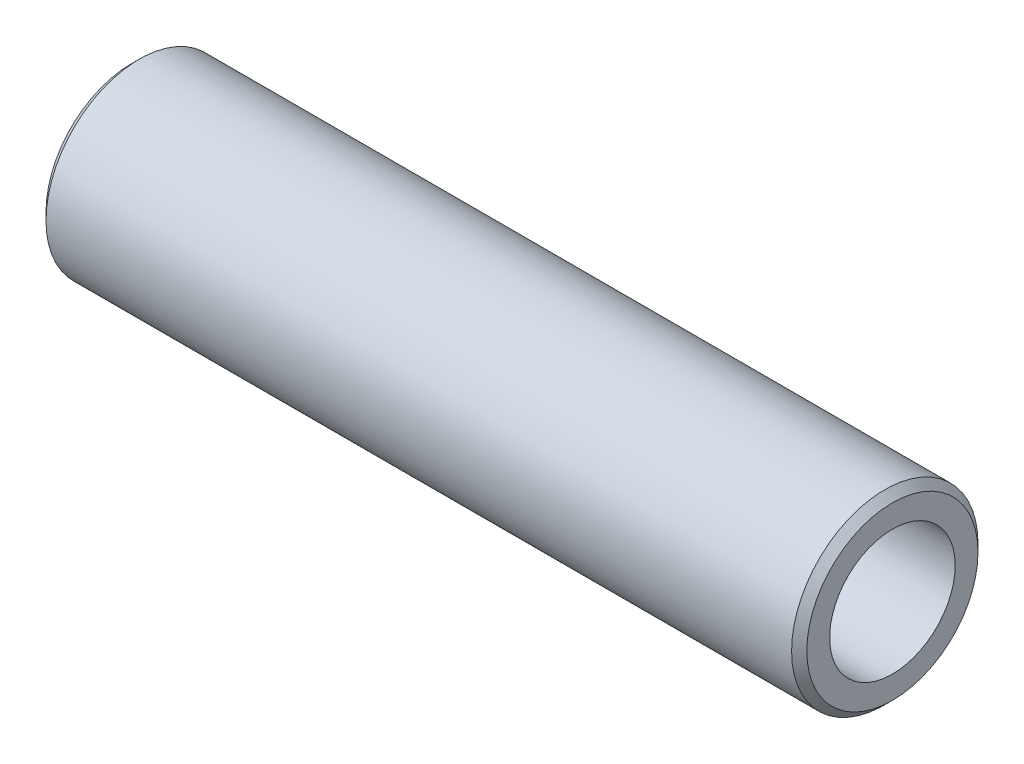
ISO-10303-21;
HEADER;
FILE_DESCRIPTION(('STEP AP214'),'2;1');
FILE_NAME('part.step','',(''),(''),'','','');
FILE_SCHEMA(('AUTOMOTIVE_DESIGN { 1 0 10303 214 1 1 1 1 }'));
ENDSEC;
DATA;
#1=APPLICATION_CONTEXT('core data for automotive mechanical design processes');
#2=APPLICATION_PROTOCOL_DEFINITION('international standard','automotive_design',2000,#1);
#3=PRODUCT_CONTEXT('',#1,'mechanical');
#4=PRODUCT('Part','Part','',(#3));
#5=PRODUCT_RELATED_PRODUCT_CATEGORY('part','',(#4));
#6=PRODUCT_DEFINITION_FORMATION('','',#4);
#7=PRODUCT_DEFINITION_CONTEXT('part definition',#1,'design');
#8=PRODUCT_DEFINITION('design','',#6,#7);
#9=PRODUCT_DEFINITION_SHAPE('','',#8);
#10=(LENGTH_UNIT() NAMED_UNIT(*) SI_UNIT(.MILLI.,.METRE.));
#11=(NAMED_UNIT(*) PLANE_ANGLE_UNIT() SI_UNIT($,.RADIAN.));
#12=(NAMED_UNIT(*) SI_UNIT($,.STERADIAN.) SOLID_ANGLE_UNIT());
#13=UNCERTAINTY_MEASURE_WITH_UNIT(LENGTH_MEASURE(1.E-05),#10,'distance_accuracy_value','');
#14=(GEOMETRIC_REPRESENTATION_CONTEXT(3) GLOBAL_UNCERTAINTY_ASSIGNED_CONTEXT((#13)) GLOBAL_UNIT_ASSIGNED_CONTEXT((#10,
#11,#12)) REPRESENTATION_CONTEXT('',''));
#15=CARTESIAN_POINT('',(0.,0.,0.));
#16=DIRECTION('',(0.,0.,1.));
#17=DIRECTION('',(1.,0.,0.));
#18=AXIS2_PLACEMENT_3D('',#15,#16,#17);
#19=CARTESIAN_POINT('',(100.,0.,0.));
#20=DIRECTION('',(1.,0.,0.));
#21=DIRECTION('',(0.,0.,-1.));
#22=AXIS2_PLACEMENT_3D('',#19,#20,#21);
#23=PLANE('',#22);
#24=CARTESIAN_POINT('',(100.,0.,0.));
#25=DIRECTION('',(1.,0.,0.));
#26=DIRECTION('',(0.,0.,-1.));
#27=AXIS2_PLACEMENT_3D('',#24,#25,#26);
#28=CIRCLE('',#27,11.25);
#29=CARTESIAN_POINT('',(100.,0.,-11.25));
#30=VERTEX_POINT('',#29);
#31=EDGE_CURVE('E10',#30,#30,#28,.T.);
#32=ORIENTED_EDGE('',*,*,#31,.T.);
#33=EDGE_LOOP('',(#32));
#34=FACE_BOUND('',#33,.T.);
#35=CARTESIAN_POINT('',(100.,0.,0.));
#36=DIRECTION('',(1.,0.,0.));
#37=DIRECTION('',(0.,0.,-1.));
#38=AXIS2_PLACEMENT_3D('',#35,#36,#37);
#39=CIRCLE('',#38,8.25);
#40=CARTESIAN_POINT('',(100.,0.,-8.25));
#41=VERTEX_POINT('',#40);
#42=EDGE_CURVE('E34',#41,#41,#39,.T.);
#43=ORIENTED_EDGE('',*,*,#42,.F.);
#44=EDGE_LOOP('',(#43));
#45=FACE_BOUND('',#44,.T.);
#46=ADVANCED_FACE('F14',(#34,#45),#23,.T.);
#47=CARTESIAN_POINT('',(0.,0.,0.));
#48=DIRECTION('',(1.,0.,0.));
#49=DIRECTION('',(0.,0.,-1.));
#50=AXIS2_PLACEMENT_3D('',#47,#48,#49);
#51=PLANE('',#50);
#52=CARTESIAN_POINT('',(0.,0.,0.));
#53=DIRECTION('',(1.,0.,0.));
#54=DIRECTION('',(0.,0.,-1.));
#55=AXIS2_PLACEMENT_3D('',#52,#53,#54);
#56=CIRCLE('',#55,11.25);
#57=CARTESIAN_POINT('',(0.,0.,-11.25));
#58=VERTEX_POINT('',#57);
#59=EDGE_CURVE('E21',#58,#58,#56,.F.);
#60=ORIENTED_EDGE('',*,*,#59,.T.);
#61=EDGE_LOOP('',(#60));
#62=FACE_BOUND('',#61,.T.);
#63=CARTESIAN_POINT('',(0.,0.,0.));
#64=DIRECTION('',(1.,0.,0.));
#65=DIRECTION('',(0.,0.,-1.));
#66=AXIS2_PLACEMENT_3D('',#63,#64,#65);
#67=CIRCLE('',#66,8.25);
#68=CARTESIAN_POINT('',(0.,0.,-8.25));
#69=VERTEX_POINT('',#68);
#70=EDGE_CURVE('E35',#69,#69,#67,.T.);
#71=ORIENTED_EDGE('',*,*,#70,.T.);
#72=EDGE_LOOP('',(#71));
#73=FACE_BOUND('',#72,.T.);
#74=ADVANCED_FACE('F45',(#62,#73),#51,.F.);
#75=CARTESIAN_POINT('',(100.,0.,0.));
#76=DIRECTION('',(-1.,0.,0.));
#77=DIRECTION('',(0.,0.,1.));
#78=AXIS2_PLACEMENT_3D('',#75,#76,#77);
#79=CYLINDRICAL_SURFACE('',#78,12.25);
#80=CARTESIAN_POINT('',(0.999999999999987,0.,0.));
#81=DIRECTION('',(1.,0.,0.));
#82=DIRECTION('',(0.,0.,-1.));
#83=AXIS2_PLACEMENT_3D('',#80,#81,#82);
#84=CIRCLE('',#83,12.25);
#85=CARTESIAN_POINT('',(0.999999999999987,0.,-12.25));
#86=VERTEX_POINT('',#85);
#87=EDGE_CURVE('E25',#86,#86,#84,.T.);
#88=ORIENTED_EDGE('',*,*,#87,.T.);
#89=EDGE_LOOP('',(#88));
#90=FACE_BOUND('',#89,.T.);
#91=CARTESIAN_POINT('',(99.,0.,0.));
#92=DIRECTION('',(1.,0.,0.));
#93=DIRECTION('',(0.,0.,-1.));
#94=AXIS2_PLACEMENT_3D('',#91,#92,#93);
#95=CIRCLE('',#94,12.25);
#96=CARTESIAN_POINT('',(99.,0.,-12.25));
#97=VERTEX_POINT('',#96);
#98=EDGE_CURVE('E29',#97,#97,#95,.F.);
#99=ORIENTED_EDGE('',*,*,#98,.T.);
#100=EDGE_LOOP('',(#99));
#101=FACE_BOUND('',#100,.T.);
#102=ADVANCED_FACE('F52',(#90,#101),#79,.T.);
#103=CARTESIAN_POINT('',(100.,0.,0.));
#104=DIRECTION('',(-1.,0.,0.));
#105=DIRECTION('',(0.,0.,1.));
#106=AXIS2_PLACEMENT_3D('',#103,#104,#105);
#107=CYLINDRICAL_SURFACE('',#106,8.25);
#108=ORIENTED_EDGE('',*,*,#42,.T.);
#109=EDGE_LOOP('',(#108));
#110=FACE_BOUND('',#109,.T.);
#111=ORIENTED_EDGE('',*,*,#70,.F.);
#112=EDGE_LOOP('',(#111));
#113=FACE_BOUND('',#112,.T.);
#114=ADVANCED_FACE('F41',(#110,#113),#107,.F.);
#115=CARTESIAN_POINT('',(0.999999999999987,0.,0.));
#116=DIRECTION('',(1.,0.,0.));
#117=DIRECTION('',(0.,0.,-1.));
#118=AXIS2_PLACEMENT_3D('',#115,#116,#117);
#119=CONICAL_SURFACE('',#118,12.25,0.785398163397449);
#120=ORIENTED_EDGE('',*,*,#59,.F.);
#121=EDGE_LOOP('',(#120));
#122=FACE_BOUND('',#121,.T.);
#123=ORIENTED_EDGE('',*,*,#87,.F.);
#124=EDGE_LOOP('',(#123));
#125=FACE_BOUND('',#124,.T.);
#126=ADVANCED_FACE('F58',(#122,#125),#119,.T.);
#127=CARTESIAN_POINT('',(100.,0.,0.));
#128=DIRECTION('',(-1.,0.,0.));
#129=DIRECTION('',(0.,0.,1.));
#130=AXIS2_PLACEMENT_3D('',#127,#128,#129);
#131=CONICAL_SURFACE('',#130,11.25,0.785398163397448);
#132=ORIENTED_EDGE('',*,*,#98,.F.);
#133=EDGE_LOOP('',(#132));
#134=FACE_BOUND('',#133,.T.);
#135=ORIENTED_EDGE('',*,*,#31,.F.);
#136=EDGE_LOOP('',(#135));
#137=FACE_BOUND('',#136,.T.);
#138=ADVANCED_FACE('F16',(#134,#137),#131,.T.);
#139=CLOSED_SHELL('',(#46,#74,#102,#114,#126,#138));
#140=MANIFOLD_SOLID_BREP('B1',#139);
#141=ADVANCED_BREP_SHAPE_REPRESENTATION('',(#18,#140),#14);
#142=SHAPE_DEFINITION_REPRESENTATION(#9,#141);
ENDSEC;
END-ISO-10303-21;
